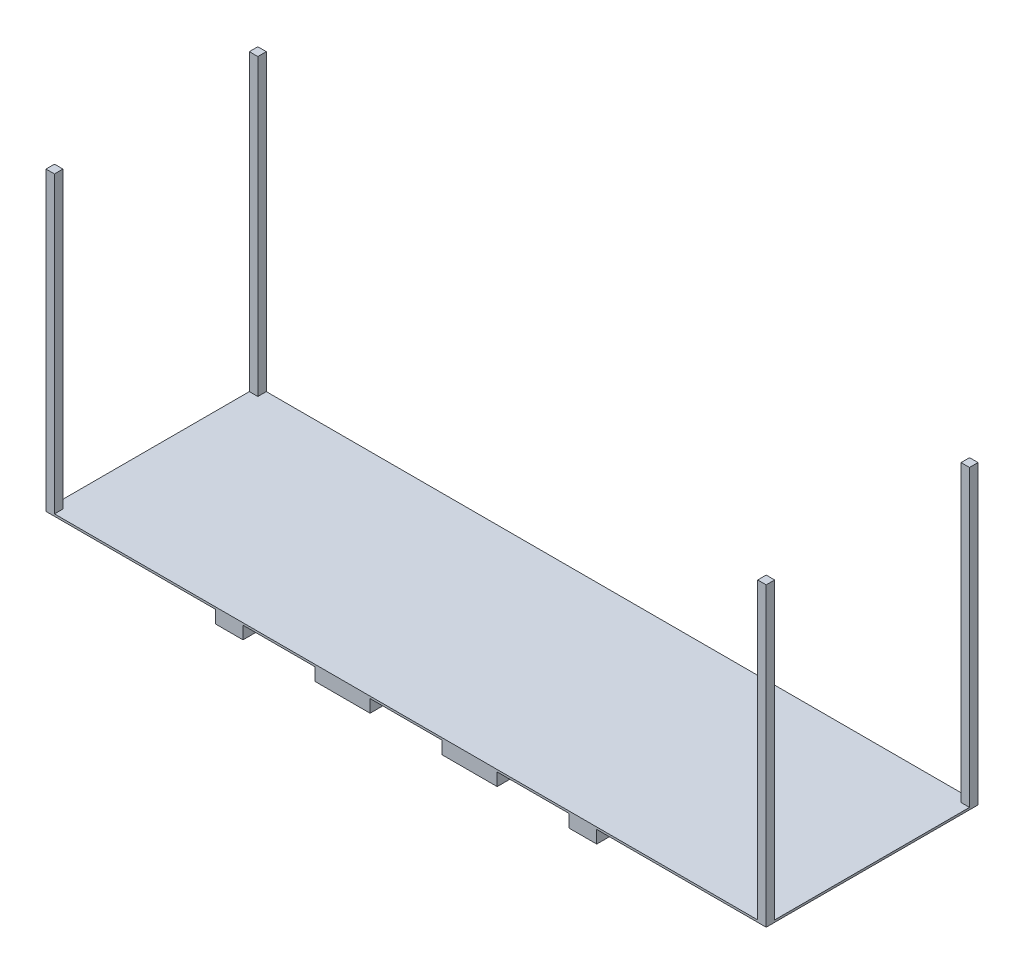
ISO-10303-21;
HEADER;
FILE_DESCRIPTION(('STEP AP214'),'2;1');
FILE_NAME('part.step','',(''),(''),'','','');
FILE_SCHEMA(('AUTOMOTIVE_DESIGN { 1 0 10303 214 1 1 1 1 }'));
ENDSEC;
DATA;
#1=APPLICATION_CONTEXT('core data for automotive mechanical design processes');
#2=APPLICATION_PROTOCOL_DEFINITION('international standard','automotive_design',2000,#1);
#3=PRODUCT_CONTEXT('',#1,'mechanical');
#4=PRODUCT('Part','Part','',(#3));
#5=PRODUCT_RELATED_PRODUCT_CATEGORY('part','',(#4));
#6=PRODUCT_DEFINITION_FORMATION('','',#4);
#7=PRODUCT_DEFINITION_CONTEXT('part definition',#1,'design');
#8=PRODUCT_DEFINITION('design','',#6,#7);
#9=PRODUCT_DEFINITION_SHAPE('','',#8);
#10=(LENGTH_UNIT() NAMED_UNIT(*) SI_UNIT(.MILLI.,.METRE.));
#11=(NAMED_UNIT(*) PLANE_ANGLE_UNIT() SI_UNIT($,.RADIAN.));
#12=(NAMED_UNIT(*) SI_UNIT($,.STERADIAN.) SOLID_ANGLE_UNIT());
#13=UNCERTAINTY_MEASURE_WITH_UNIT(LENGTH_MEASURE(1.E-05),#10,'distance_accuracy_value','');
#14=(GEOMETRIC_REPRESENTATION_CONTEXT(3) GLOBAL_UNCERTAINTY_ASSIGNED_CONTEXT((#13)) GLOBAL_UNIT_ASSIGNED_CONTEXT((#10,
#11,#12)) REPRESENTATION_CONTEXT('',''));
#15=CARTESIAN_POINT('',(0.,0.,0.));
#16=DIRECTION('',(0.,0.,1.));
#17=DIRECTION('',(1.,0.,0.));
#18=AXIS2_PLACEMENT_3D('',#15,#16,#17);
#19=CARTESIAN_POINT('',(0.,-30.,0.));
#20=DIRECTION('',(0.,1.,0.));
#21=DIRECTION('',(0.,0.,1.));
#22=AXIS2_PLACEMENT_3D('',#19,#20,#21);
#23=PLANE('',#22);
#24=DIRECTION('',(1.,0.,0.));
#25=VECTOR('',#24,1.);
#26=CARTESIAN_POINT('',(400.,-30.,-500.));
#27=LINE('',#26,#25);
#28=CARTESIAN_POINT('',(635.,-30.,-500.));
#29=VERTEX_POINT('',#28);
#30=CARTESIAN_POINT('',(765.,-30.,-500.));
#31=VERTEX_POINT('',#30);
#32=EDGE_CURVE('E340',#29,#31,#27,.T.);
#33=ORIENTED_EDGE('',*,*,#32,.T.);
#34=DIRECTION('',(0.,0.,-1.));
#35=VECTOR('',#34,1.);
#36=CARTESIAN_POINT('',(765.,-30.,-500.));
#37=LINE('',#36,#35);
#38=CARTESIAN_POINT('',(765.,-30.,0.));
#39=VERTEX_POINT('',#38);
#40=EDGE_CURVE('E247',#39,#31,#37,.T.);
#41=ORIENTED_EDGE('',*,*,#40,.F.);
#42=DIRECTION('',(-1.,0.,0.));
#43=VECTOR('',#42,1.);
#44=CARTESIAN_POINT('',(400.,-30.,0.));
#45=LINE('',#44,#43);
#46=CARTESIAN_POINT('',(635.,-30.,0.));
#47=VERTEX_POINT('',#46);
#48=EDGE_CURVE('E348',#39,#47,#45,.T.);
#49=ORIENTED_EDGE('',*,*,#48,.T.);
#50=DIRECTION('',(0.,0.,1.));
#51=VECTOR('',#50,1.);
#52=CARTESIAN_POINT('',(635.,-30.,0.));
#53=LINE('',#52,#51);
#54=EDGE_CURVE('E308',#29,#47,#53,.T.);
#55=ORIENTED_EDGE('',*,*,#54,.F.);
#56=EDGE_LOOP('',(#33,#41,#49,#55));
#57=FACE_BOUND('',#56,.T.);
#58=ADVANCED_FACE('F33',(#57),#23,.F.);
#59=CARTESIAN_POINT('',(1065.,-30.,0.));
#60=VERTEX_POINT('',#59);
#61=CARTESIAN_POINT('',(935.,-30.,0.));
#62=VERTEX_POINT('',#61);
#63=EDGE_CURVE('E347',#60,#62,#45,.T.);
#64=ORIENTED_EDGE('',*,*,#63,.T.);
#65=DIRECTION('',(0.,0.,1.));
#66=VECTOR('',#65,1.);
#67=CARTESIAN_POINT('',(935.,-30.,-500.));
#68=LINE('',#67,#66);
#69=CARTESIAN_POINT('',(935.,-30.,-500.));
#70=VERTEX_POINT('',#69);
#71=EDGE_CURVE('E261',#70,#62,#68,.T.);
#72=ORIENTED_EDGE('',*,*,#71,.F.);
#73=CARTESIAN_POINT('',(1065.,-30.,-500.));
#74=VERTEX_POINT('',#73);
#75=EDGE_CURVE('E511',#70,#74,#27,.T.);
#76=ORIENTED_EDGE('',*,*,#75,.T.);
#77=DIRECTION('',(0.,0.,-1.));
#78=VECTOR('',#77,1.);
#79=CARTESIAN_POINT('',(1065.,-30.,-500.));
#80=LINE('',#79,#78);
#81=EDGE_CURVE('E294',#60,#74,#80,.T.);
#82=ORIENTED_EDGE('',*,*,#81,.F.);
#83=EDGE_LOOP('',(#64,#72,#76,#82));
#84=FACE_BOUND('',#83,.T.);
#85=ADVANCED_FACE('F590',(#84),#23,.F.);
#86=CARTESIAN_POINT('',(400.,-30.,-500.));
#87=VERTEX_POINT('',#86);
#88=CARTESIAN_POINT('',(465.,-30.,-500.));
#89=VERTEX_POINT('',#88);
#90=EDGE_CURVE('E336',#87,#89,#27,.T.);
#91=ORIENTED_EDGE('',*,*,#90,.T.);
#92=DIRECTION('',(0.,0.,-1.));
#93=VECTOR('',#92,1.);
#94=CARTESIAN_POINT('',(465.,-30.,0.));
#95=LINE('',#94,#93);
#96=CARTESIAN_POINT('',(465.,-30.,0.));
#97=VERTEX_POINT('',#96);
#98=EDGE_CURVE('E275',#97,#89,#95,.T.);
#99=ORIENTED_EDGE('',*,*,#98,.F.);
#100=CARTESIAN_POINT('',(400.,-30.,0.));
#101=VERTEX_POINT('',#100);
#102=EDGE_CURVE('E342',#97,#101,#45,.T.);
#103=ORIENTED_EDGE('',*,*,#102,.T.);
#104=DIRECTION('',(0.,0.,-1.));
#105=VECTOR('',#104,1.);
#106=CARTESIAN_POINT('',(400.,-30.,-500.));
#107=LINE('',#106,#105);
#108=EDGE_CURVE('E331',#101,#87,#107,.T.);
#109=ORIENTED_EDGE('',*,*,#108,.T.);
#110=EDGE_LOOP('',(#91,#99,#103,#109));
#111=FACE_BOUND('',#110,.T.);
#112=ADVANCED_FACE('F530',(#111),#23,.F.);
#113=CARTESIAN_POINT('',(0.,0.,0.));
#114=DIRECTION('',(0.,-1.,0.));
#115=DIRECTION('',(0.,0.,-1.));
#116=AXIS2_PLACEMENT_3D('',#113,#114,#115);
#117=PLANE('',#116);
#118=DIRECTION('',(0.,0.,-1.));
#119=VECTOR('',#118,1.);
#120=CARTESIAN_POINT('',(400.,0.,-500.));
#121=LINE('',#120,#119);
#122=CARTESIAN_POINT('',(400.,0.,0.));
#123=VERTEX_POINT('',#122);
#124=CARTESIAN_POINT('',(400.,0.,-500.));
#125=VERTEX_POINT('',#124);
#126=EDGE_CURVE('E323',#123,#125,#121,.T.);
#127=ORIENTED_EDGE('',*,*,#126,.F.);
#128=DIRECTION('',(1.,0.,0.));
#129=VECTOR('',#128,1.);
#130=CARTESIAN_POINT('',(0.,0.,0.));
#131=LINE('',#130,#129);
#132=CARTESIAN_POINT('',(0.,0.,0.));
#133=VERTEX_POINT('',#132);
#134=EDGE_CURVE('E478',#133,#123,#131,.T.);
#135=ORIENTED_EDGE('',*,*,#134,.F.);
#136=DIRECTION('',(0.,0.,1.));
#137=VECTOR('',#136,1.);
#138=CARTESIAN_POINT('',(0.,0.,0.));
#139=LINE('',#138,#137);
#140=CARTESIAN_POINT('',(0.,0.,-500.));
#141=VERTEX_POINT('',#140);
#142=EDGE_CURVE('E464',#141,#133,#139,.T.);
#143=ORIENTED_EDGE('',*,*,#142,.F.);
#144=DIRECTION('',(-1.,0.,0.));
#145=VECTOR('',#144,1.);
#146=CARTESIAN_POINT('',(0.,0.,-500.));
#147=LINE('',#146,#145);
#148=EDGE_CURVE('E483',#125,#141,#147,.T.);
#149=ORIENTED_EDGE('',*,*,#148,.F.);
#150=EDGE_LOOP('',(#127,#135,#143,#149));
#151=FACE_BOUND('',#150,.T.);
#152=ADVANCED_FACE('F543',(#151),#117,.T.);
#153=CARTESIAN_POINT('',(0.,5.,0.));
#154=DIRECTION('',(0.,-1.,0.));
#155=DIRECTION('',(0.,0.,-1.));
#156=AXIS2_PLACEMENT_3D('',#153,#154,#155);
#157=PLANE('',#156);
#158=DIRECTION('',(0.,0.,1.));
#159=VECTOR('',#158,1.);
#160=CARTESIAN_POINT('',(1680.,5.,-500.));
#161=LINE('',#160,#159);
#162=CARTESIAN_POINT('',(1680.,5.,-500.));
#163=VERTEX_POINT('',#162);
#164=CARTESIAN_POINT('',(1680.,5.,-480.));
#165=VERTEX_POINT('',#164);
#166=EDGE_CURVE('E364',#163,#165,#161,.T.);
#167=ORIENTED_EDGE('',*,*,#166,.F.);
#168=DIRECTION('',(-1.,0.,0.));
#169=VECTOR('',#168,1.);
#170=CARTESIAN_POINT('',(0.,5.,-500.));
#171=LINE('',#170,#169);
#172=CARTESIAN_POINT('',(20.,5.,-500.));
#173=VERTEX_POINT('',#172);
#174=EDGE_CURVE('E472',#163,#173,#171,.T.);
#175=ORIENTED_EDGE('',*,*,#174,.T.);
#176=DIRECTION('',(0.,0.,-1.));
#177=VECTOR('',#176,1.);
#178=CARTESIAN_POINT('',(20.,5.,-500.));
#179=LINE('',#178,#177);
#180=CARTESIAN_POINT('',(20.,5.,-480.));
#181=VERTEX_POINT('',#180);
#182=EDGE_CURVE('E444',#181,#173,#179,.T.);
#183=ORIENTED_EDGE('',*,*,#182,.F.);
#184=DIRECTION('',(1.,0.,0.));
#185=VECTOR('',#184,1.);
#186=CARTESIAN_POINT('',(0.,5.,-480.));
#187=LINE('',#186,#185);
#188=CARTESIAN_POINT('',(0.,5.,-480.));
#189=VERTEX_POINT('',#188);
#190=EDGE_CURVE('E439',#189,#181,#187,.T.);
#191=ORIENTED_EDGE('',*,*,#190,.F.);
#192=DIRECTION('',(0.,0.,1.));
#193=VECTOR('',#192,1.);
#194=CARTESIAN_POINT('',(0.,5.,0.));
#195=LINE('',#194,#193);
#196=CARTESIAN_POINT('',(0.,5.,-20.));
#197=VERTEX_POINT('',#196);
#198=EDGE_CURVE('E465',#189,#197,#195,.T.);
#199=ORIENTED_EDGE('',*,*,#198,.T.);
#200=DIRECTION('',(-1.,0.,0.));
#201=VECTOR('',#200,1.);
#202=CARTESIAN_POINT('',(0.,5.,-20.));
#203=LINE('',#202,#201);
#204=CARTESIAN_POINT('',(20.,5.,-20.));
#205=VERTEX_POINT('',#204);
#206=EDGE_CURVE('E419',#205,#197,#203,.T.);
#207=ORIENTED_EDGE('',*,*,#206,.F.);
#208=DIRECTION('',(0.,0.,-1.));
#209=VECTOR('',#208,1.);
#210=CARTESIAN_POINT('',(20.,5.,0.));
#211=LINE('',#210,#209);
#212=CARTESIAN_POINT('',(20.,5.,0.));
#213=VERTEX_POINT('',#212);
#214=EDGE_CURVE('E414',#213,#205,#211,.T.);
#215=ORIENTED_EDGE('',*,*,#214,.F.);
#216=DIRECTION('',(1.,0.,0.));
#217=VECTOR('',#216,1.);
#218=CARTESIAN_POINT('',(0.,5.,0.));
#219=LINE('',#218,#217);
#220=CARTESIAN_POINT('',(1680.,5.,0.));
#221=VERTEX_POINT('',#220);
#222=EDGE_CURVE('E467',#213,#221,#219,.T.);
#223=ORIENTED_EDGE('',*,*,#222,.T.);
#224=DIRECTION('',(0.,0.,1.));
#225=VECTOR('',#224,1.);
#226=CARTESIAN_POINT('',(1680.,5.,-4.44089209850063E-13));
#227=LINE('',#226,#225);
#228=CARTESIAN_POINT('',(1680.,5.,-20.0000000000005));
#229=VERTEX_POINT('',#228);
#230=EDGE_CURVE('E394',#229,#221,#227,.T.);
#231=ORIENTED_EDGE('',*,*,#230,.F.);
#232=DIRECTION('',(-1.,0.,0.));
#233=VECTOR('',#232,1.);
#234=CARTESIAN_POINT('',(1700.,5.,-20.0000000000005));
#235=LINE('',#234,#233);
#236=CARTESIAN_POINT('',(1700.,5.,-20.0000000000005));
#237=VERTEX_POINT('',#236);
#238=EDGE_CURVE('E389',#237,#229,#235,.T.);
#239=ORIENTED_EDGE('',*,*,#238,.F.);
#240=DIRECTION('',(0.,0.,-1.));
#241=VECTOR('',#240,1.);
#242=CARTESIAN_POINT('',(1700.,5.,0.));
#243=LINE('',#242,#241);
#244=CARTESIAN_POINT('',(1700.,5.,-480.));
#245=VERTEX_POINT('',#244);
#246=EDGE_CURVE('E470',#237,#245,#243,.T.);
#247=ORIENTED_EDGE('',*,*,#246,.T.);
#248=DIRECTION('',(1.,0.,0.));
#249=VECTOR('',#248,1.);
#250=CARTESIAN_POINT('',(1700.,5.,-480.));
#251=LINE('',#250,#249);
#252=EDGE_CURVE('E369',#165,#245,#251,.T.);
#253=ORIENTED_EDGE('',*,*,#252,.F.);
#254=EDGE_LOOP('',(#167,#175,#183,#191,#199,#207,#215,#223,#231,#239,#247,#253));
#255=FACE_BOUND('',#254,.T.);
#256=ADVANCED_FACE('F568',(#255),#157,.F.);
#257=CARTESIAN_POINT('',(0.,5.,0.));
#258=DIRECTION('',(1.,0.,0.));
#259=DIRECTION('',(0.,0.,-1.));
#260=AXIS2_PLACEMENT_3D('',#257,#258,#259);
#261=PLANE('',#260);
#262=ORIENTED_EDGE('',*,*,#142,.T.);
#263=DIRECTION('',(0.,-1.,0.));
#264=VECTOR('',#263,1.);
#265=CARTESIAN_POINT('',(0.,5.,0.));
#266=LINE('',#265,#264);
#267=CARTESIAN_POINT('',(0.,700.,0.));
#268=VERTEX_POINT('',#267);
#269=EDGE_CURVE('E11',#268,#133,#266,.T.);
#270=ORIENTED_EDGE('',*,*,#269,.F.);
#271=DIRECTION('',(0.,0.,1.));
#272=VECTOR('',#271,1.);
#273=CARTESIAN_POINT('',(0.,700.,0.));
#274=LINE('',#273,#272);
#275=CARTESIAN_POINT('',(0.,700.,-20.));
#276=VERTEX_POINT('',#275);
#277=EDGE_CURVE('E423',#276,#268,#274,.T.);
#278=ORIENTED_EDGE('',*,*,#277,.F.);
#279=DIRECTION('',(0.,-1.,0.));
#280=VECTOR('',#279,1.);
#281=CARTESIAN_POINT('',(0.,700.,-20.));
#282=LINE('',#281,#280);
#283=EDGE_CURVE('E426',#276,#197,#282,.T.);
#284=ORIENTED_EDGE('',*,*,#283,.T.);
#285=ORIENTED_EDGE('',*,*,#198,.F.);
#286=DIRECTION('',(0.,-1.,0.));
#287=VECTOR('',#286,1.);
#288=CARTESIAN_POINT('',(0.,700.,-480.));
#289=LINE('',#288,#287);
#290=CARTESIAN_POINT('',(0.,700.,-480.));
#291=VERTEX_POINT('',#290);
#292=EDGE_CURVE('E461',#291,#189,#289,.T.);
#293=ORIENTED_EDGE('',*,*,#292,.F.);
#294=DIRECTION('',(0.,0.,1.));
#295=VECTOR('',#294,1.);
#296=CARTESIAN_POINT('',(0.,700.,-500.));
#297=LINE('',#296,#295);
#298=CARTESIAN_POINT('',(0.,700.,-500.));
#299=VERTEX_POINT('',#298);
#300=EDGE_CURVE('E440',#299,#291,#297,.T.);
#301=ORIENTED_EDGE('',*,*,#300,.F.);
#302=DIRECTION('',(0.,-1.,0.));
#303=VECTOR('',#302,1.);
#304=CARTESIAN_POINT('',(0.,5.,-500.));
#305=LINE('',#304,#303);
#306=EDGE_CURVE('E474',#299,#141,#305,.T.);
#307=ORIENTED_EDGE('',*,*,#306,.T.);
#308=EDGE_LOOP('',(#262,#270,#278,#284,#285,#293,#301,#307));
#309=FACE_BOUND('',#308,.T.);
#310=ADVANCED_FACE('F35',(#309),#261,.F.);
#311=CARTESIAN_POINT('',(0.,5.,0.));
#312=DIRECTION('',(0.,0.,-1.));
#313=DIRECTION('',(-1.,0.,0.));
#314=AXIS2_PLACEMENT_3D('',#311,#312,#313);
#315=PLANE('',#314);
#316=ORIENTED_EDGE('',*,*,#48,.F.);
#317=DIRECTION('',(0.,-1.,0.));
#318=VECTOR('',#317,1.);
#319=CARTESIAN_POINT('',(765.,0.,0.));
#320=LINE('',#319,#318);
#321=CARTESIAN_POINT('',(765.,0.,0.));
#322=VERTEX_POINT('',#321);
#323=EDGE_CURVE('E273',#322,#39,#320,.T.);
#324=ORIENTED_EDGE('',*,*,#323,.F.);
#325=DIRECTION('',(-1.,0.,0.));
#326=VECTOR('',#325,1.);
#327=CARTESIAN_POINT('',(765.,0.,0.));
#328=LINE('',#327,#326);
#329=CARTESIAN_POINT('',(935.,0.,0.));
#330=VERTEX_POINT('',#329);
#331=EDGE_CURVE('E252',#330,#322,#328,.T.);
#332=ORIENTED_EDGE('',*,*,#331,.F.);
#333=DIRECTION('',(0.,-1.,0.));
#334=VECTOR('',#333,1.);
#335=CARTESIAN_POINT('',(935.,0.,0.));
#336=LINE('',#335,#334);
#337=EDGE_CURVE('E276',#330,#62,#336,.T.);
#338=ORIENTED_EDGE('',*,*,#337,.T.);
#339=ORIENTED_EDGE('',*,*,#63,.F.);
#340=DIRECTION('',(0.,-1.,0.));
#341=VECTOR('',#340,1.);
#342=CARTESIAN_POINT('',(1065.,0.,0.));
#343=LINE('',#342,#341);
#344=CARTESIAN_POINT('',(1065.,0.,0.));
#345=VERTEX_POINT('',#344);
#346=EDGE_CURVE('E271',#345,#60,#343,.T.);
#347=ORIENTED_EDGE('',*,*,#346,.F.);
#348=DIRECTION('',(-1.,0.,0.));
#349=VECTOR('',#348,1.);
#350=CARTESIAN_POINT('',(1065.,0.,0.));
#351=LINE('',#350,#349);
#352=CARTESIAN_POINT('',(1235.,0.,0.));
#353=VERTEX_POINT('',#352);
#354=EDGE_CURVE('E290',#353,#345,#351,.T.);
#355=ORIENTED_EDGE('',*,*,#354,.F.);
#356=DIRECTION('',(0.,-1.,0.));
#357=VECTOR('',#356,1.);
#358=CARTESIAN_POINT('',(1235.,0.,0.));
#359=LINE('',#358,#357);
#360=CARTESIAN_POINT('',(1235.,-30.,0.));
#361=VERTEX_POINT('',#360);
#362=EDGE_CURVE('E298',#353,#361,#359,.T.);
#363=ORIENTED_EDGE('',*,*,#362,.T.);
#364=CARTESIAN_POINT('',(1300.,-30.,0.));
#365=VERTEX_POINT('',#364);
#366=EDGE_CURVE('E343',#365,#361,#45,.T.);
#367=ORIENTED_EDGE('',*,*,#366,.F.);
#368=DIRECTION('',(0.,1.,0.));
#369=VECTOR('',#368,1.);
#370=CARTESIAN_POINT('',(1300.,-30.,0.));
#371=LINE('',#370,#369);
#372=CARTESIAN_POINT('',(1300.,0.,0.));
#373=VERTEX_POINT('',#372);
#374=EDGE_CURVE('E355',#365,#373,#371,.T.);
#375=ORIENTED_EDGE('',*,*,#374,.T.);
#376=CARTESIAN_POINT('',(1700.,0.,0.));
#377=VERTEX_POINT('',#376);
#378=EDGE_CURVE('E477',#373,#377,#131,.T.);
#379=ORIENTED_EDGE('',*,*,#378,.T.);
#380=DIRECTION('',(0.,-1.,0.));
#381=VECTOR('',#380,1.);
#382=CARTESIAN_POINT('',(1700.,5.,0.));
#383=LINE('',#382,#381);
#384=CARTESIAN_POINT('',(1700.,700.,-4.44089209850063E-13));
#385=VERTEX_POINT('',#384);
#386=EDGE_CURVE('E41',#385,#377,#383,.T.);
#387=ORIENTED_EDGE('',*,*,#386,.F.);
#388=DIRECTION('',(1.,0.,0.));
#389=VECTOR('',#388,1.);
#390=CARTESIAN_POINT('',(1700.,700.,-4.44089209850063E-13));
#391=LINE('',#390,#389);
#392=CARTESIAN_POINT('',(1680.,700.,-4.44089209850063E-13));
#393=VERTEX_POINT('',#392);
#394=EDGE_CURVE('E398',#393,#385,#391,.T.);
#395=ORIENTED_EDGE('',*,*,#394,.F.);
#396=DIRECTION('',(0.,-1.,0.));
#397=VECTOR('',#396,1.);
#398=CARTESIAN_POINT('',(1680.,700.,-4.44089209850063E-13));
#399=LINE('',#398,#397);
#400=EDGE_CURVE('E401',#393,#221,#399,.T.);
#401=ORIENTED_EDGE('',*,*,#400,.T.);
#402=ORIENTED_EDGE('',*,*,#222,.F.);
#403=DIRECTION('',(0.,-1.,0.));
#404=VECTOR('',#403,1.);
#405=CARTESIAN_POINT('',(20.,700.,0.));
#406=LINE('',#405,#404);
#407=CARTESIAN_POINT('',(20.,700.,0.));
#408=VERTEX_POINT('',#407);
#409=EDGE_CURVE('E436',#408,#213,#406,.T.);
#410=ORIENTED_EDGE('',*,*,#409,.F.);
#411=DIRECTION('',(1.,0.,0.));
#412=VECTOR('',#411,1.);
#413=CARTESIAN_POINT('',(0.,700.,0.));
#414=LINE('',#413,#412);
#415=EDGE_CURVE('E415',#268,#408,#414,.T.);
#416=ORIENTED_EDGE('',*,*,#415,.F.);
#417=ORIENTED_EDGE('',*,*,#269,.T.);
#418=ORIENTED_EDGE('',*,*,#134,.T.);
#419=DIRECTION('',(0.,1.,0.));
#420=VECTOR('',#419,1.);
#421=CARTESIAN_POINT('',(400.,-30.,0.));
#422=LINE('',#421,#420);
#423=EDGE_CURVE('E346',#101,#123,#422,.T.);
#424=ORIENTED_EDGE('',*,*,#423,.F.);
#425=ORIENTED_EDGE('',*,*,#102,.F.);
#426=DIRECTION('',(0.,-1.,0.));
#427=VECTOR('',#426,1.);
#428=CARTESIAN_POINT('',(465.,0.,0.));
#429=LINE('',#428,#427);
#430=CARTESIAN_POINT('',(465.,0.,0.));
#431=VERTEX_POINT('',#430);
#432=EDGE_CURVE('E321',#431,#97,#429,.T.);
#433=ORIENTED_EDGE('',*,*,#432,.F.);
#434=DIRECTION('',(-1.,0.,0.));
#435=VECTOR('',#434,1.);
#436=CARTESIAN_POINT('',(465.,0.,0.));
#437=LINE('',#436,#435);
#438=CARTESIAN_POINT('',(635.,0.,0.));
#439=VERTEX_POINT('',#438);
#440=EDGE_CURVE('E314',#439,#431,#437,.T.);
#441=ORIENTED_EDGE('',*,*,#440,.F.);
#442=DIRECTION('',(0.,-1.,0.));
#443=VECTOR('',#442,1.);
#444=CARTESIAN_POINT('',(635.,0.,0.));
#445=LINE('',#444,#443);
#446=EDGE_CURVE('E324',#439,#47,#445,.T.);
#447=ORIENTED_EDGE('',*,*,#446,.T.);
#448=EDGE_LOOP('',(#316,#324,#332,#338,#339,#347,#355,#363,#367,#375,#379,#387,#395,#401,#402,
#410,#416,#417,#418,#424,#425,#433,#441,#447));
#449=FACE_BOUND('',#448,.T.);
#450=ADVANCED_FACE('F545',(#449),#315,.F.);
#451=CARTESIAN_POINT('',(1700.,5.,0.));
#452=DIRECTION('',(-1.,0.,0.));
#453=DIRECTION('',(0.,0.,1.));
#454=AXIS2_PLACEMENT_3D('',#451,#452,#453);
#455=PLANE('',#454);
#456=DIRECTION('',(0.,0.,-1.));
#457=VECTOR('',#456,1.);
#458=CARTESIAN_POINT('',(1700.,0.,0.));
#459=LINE('',#458,#457);
#460=CARTESIAN_POINT('',(1700.,0.,-500.));
#461=VERTEX_POINT('',#460);
#462=EDGE_CURVE('E481',#377,#461,#459,.T.);
#463=ORIENTED_EDGE('',*,*,#462,.T.);
#464=DIRECTION('',(0.,-1.,0.));
#465=VECTOR('',#464,1.);
#466=CARTESIAN_POINT('',(1700.,5.,-500.));
#467=LINE('',#466,#465);
#468=CARTESIAN_POINT('',(1700.,700.,-500.));
#469=VERTEX_POINT('',#468);
#470=EDGE_CURVE('E488',#469,#461,#467,.T.);
#471=ORIENTED_EDGE('',*,*,#470,.F.);
#472=DIRECTION('',(0.,0.,-1.));
#473=VECTOR('',#472,1.);
#474=CARTESIAN_POINT('',(1700.,700.,-500.));
#475=LINE('',#474,#473);
#476=CARTESIAN_POINT('',(1700.,700.,-480.));
#477=VERTEX_POINT('',#476);
#478=EDGE_CURVE('E373',#477,#469,#475,.T.);
#479=ORIENTED_EDGE('',*,*,#478,.F.);
#480=DIRECTION('',(0.,-1.,0.));
#481=VECTOR('',#480,1.);
#482=CARTESIAN_POINT('',(1700.,700.,-480.));
#483=LINE('',#482,#481);
#484=EDGE_CURVE('E376',#477,#245,#483,.T.);
#485=ORIENTED_EDGE('',*,*,#484,.T.);
#486=ORIENTED_EDGE('',*,*,#246,.F.);
#487=DIRECTION('',(0.,-1.,0.));
#488=VECTOR('',#487,1.);
#489=CARTESIAN_POINT('',(1700.,700.,-20.0000000000005));
#490=LINE('',#489,#488);
#491=CARTESIAN_POINT('',(1700.,700.,-20.0000000000005));
#492=VERTEX_POINT('',#491);
#493=EDGE_CURVE('E411',#492,#237,#490,.T.);
#494=ORIENTED_EDGE('',*,*,#493,.F.);
#495=DIRECTION('',(0.,0.,-1.));
#496=VECTOR('',#495,1.);
#497=CARTESIAN_POINT('',(1700.,700.,-4.44089209850063E-13));
#498=LINE('',#497,#496);
#499=EDGE_CURVE('E390',#385,#492,#498,.T.);
#500=ORIENTED_EDGE('',*,*,#499,.F.);
#501=ORIENTED_EDGE('',*,*,#386,.T.);
#502=EDGE_LOOP('',(#463,#471,#479,#485,#486,#494,#500,#501));
#503=FACE_BOUND('',#502,.T.);
#504=ADVANCED_FACE('F494',(#503),#455,.F.);
#505=CARTESIAN_POINT('',(0.,5.,-500.));
#506=DIRECTION('',(0.,0.,1.));
#507=DIRECTION('',(1.,0.,0.));
#508=AXIS2_PLACEMENT_3D('',#505,#506,#507);
#509=PLANE('',#508);
#510=DIRECTION('',(1.,0.,0.));
#511=VECTOR('',#510,1.);
#512=CARTESIAN_POINT('',(765.,0.,-500.));
#513=LINE('',#512,#511);
#514=CARTESIAN_POINT('',(765.,0.,-500.));
#515=VERTEX_POINT('',#514);
#516=CARTESIAN_POINT('',(935.,0.,-500.));
#517=VERTEX_POINT('',#516);
#518=EDGE_CURVE('E258',#515,#517,#513,.T.);
#519=ORIENTED_EDGE('',*,*,#518,.F.);
#520=DIRECTION('',(0.,-1.,0.));
#521=VECTOR('',#520,1.);
#522=CARTESIAN_POINT('',(765.,0.,-500.));
#523=LINE('',#522,#521);
#524=EDGE_CURVE('E241',#515,#31,#523,.T.);
#525=ORIENTED_EDGE('',*,*,#524,.T.);
#526=ORIENTED_EDGE('',*,*,#32,.F.);
#527=DIRECTION('',(0.,-1.,0.));
#528=VECTOR('',#527,1.);
#529=CARTESIAN_POINT('',(635.,0.,-500.));
#530=LINE('',#529,#528);
#531=CARTESIAN_POINT('',(635.,0.,-500.));
#532=VERTEX_POINT('',#531);
#533=EDGE_CURVE('E327',#532,#29,#530,.T.);
#534=ORIENTED_EDGE('',*,*,#533,.F.);
#535=DIRECTION('',(1.,0.,0.));
#536=VECTOR('',#535,1.);
#537=CARTESIAN_POINT('',(465.,0.,-500.));
#538=LINE('',#537,#536);
#539=CARTESIAN_POINT('',(465.,0.,-500.));
#540=VERTEX_POINT('',#539);
#541=EDGE_CURVE('E307',#540,#532,#538,.T.);
#542=ORIENTED_EDGE('',*,*,#541,.F.);
#543=DIRECTION('',(0.,-1.,0.));
#544=VECTOR('',#543,1.);
#545=CARTESIAN_POINT('',(465.,0.,-500.));
#546=LINE('',#545,#544);
#547=EDGE_CURVE('E317',#540,#89,#546,.T.);
#548=ORIENTED_EDGE('',*,*,#547,.T.);
#549=ORIENTED_EDGE('',*,*,#90,.F.);
#550=DIRECTION('',(0.,1.,0.));
#551=VECTOR('',#550,1.);
#552=CARTESIAN_POINT('',(400.,-30.,-500.));
#553=LINE('',#552,#551);
#554=EDGE_CURVE('E361',#87,#125,#553,.T.);
#555=ORIENTED_EDGE('',*,*,#554,.T.);
#556=ORIENTED_EDGE('',*,*,#148,.T.);
#557=ORIENTED_EDGE('',*,*,#306,.F.);
#558=DIRECTION('',(-1.,0.,0.));
#559=VECTOR('',#558,1.);
#560=CARTESIAN_POINT('',(0.,700.,-500.));
#561=LINE('',#560,#559);
#562=CARTESIAN_POINT('',(20.,700.,-500.));
#563=VERTEX_POINT('',#562);
#564=EDGE_CURVE('E448',#563,#299,#561,.T.);
#565=ORIENTED_EDGE('',*,*,#564,.F.);
#566=DIRECTION('',(0.,-1.,0.));
#567=VECTOR('',#566,1.);
#568=CARTESIAN_POINT('',(20.,700.,-500.));
#569=LINE('',#568,#567);
#570=EDGE_CURVE('E451',#563,#173,#569,.T.);
#571=ORIENTED_EDGE('',*,*,#570,.T.);
#572=ORIENTED_EDGE('',*,*,#174,.F.);
#573=DIRECTION('',(0.,-1.,0.));
#574=VECTOR('',#573,1.);
#575=CARTESIAN_POINT('',(1680.,700.,-500.));
#576=LINE('',#575,#574);
#577=CARTESIAN_POINT('',(1680.,700.,-500.));
#578=VERTEX_POINT('',#577);
#579=EDGE_CURVE('E386',#578,#163,#576,.T.);
#580=ORIENTED_EDGE('',*,*,#579,.F.);
#581=DIRECTION('',(-1.,0.,0.));
#582=VECTOR('',#581,1.);
#583=CARTESIAN_POINT('',(1700.,700.,-500.));
#584=LINE('',#583,#582);
#585=EDGE_CURVE('E365',#469,#578,#584,.T.);
#586=ORIENTED_EDGE('',*,*,#585,.F.);
#587=ORIENTED_EDGE('',*,*,#470,.T.);
#588=CARTESIAN_POINT('',(1300.,0.,-500.));
#589=VERTEX_POINT('',#588);
#590=EDGE_CURVE('E468',#461,#589,#147,.T.);
#591=ORIENTED_EDGE('',*,*,#590,.T.);
#592=DIRECTION('',(0.,1.,0.));
#593=VECTOR('',#592,1.);
#594=CARTESIAN_POINT('',(1300.,-30.,-500.));
#595=LINE('',#594,#593);
#596=CARTESIAN_POINT('',(1300.,-30.,-500.));
#597=VERTEX_POINT('',#596);
#598=EDGE_CURVE('E358',#597,#589,#595,.T.);
#599=ORIENTED_EDGE('',*,*,#598,.F.);
#600=CARTESIAN_POINT('',(1235.,-30.,-500.));
#601=VERTEX_POINT('',#600);
#602=EDGE_CURVE('E334',#601,#597,#27,.T.);
#603=ORIENTED_EDGE('',*,*,#602,.F.);
#604=DIRECTION('',(0.,-1.,0.));
#605=VECTOR('',#604,1.);
#606=CARTESIAN_POINT('',(1235.,0.,-500.));
#607=LINE('',#606,#605);
#608=CARTESIAN_POINT('',(1235.,0.,-500.));
#609=VERTEX_POINT('',#608);
#610=EDGE_CURVE('E48',#609,#601,#607,.T.);
#611=ORIENTED_EDGE('',*,*,#610,.F.);
#612=DIRECTION('',(1.,0.,0.));
#613=VECTOR('',#612,1.);
#614=CARTESIAN_POINT('',(1065.,0.,-500.));
#615=LINE('',#614,#613);
#616=CARTESIAN_POINT('',(1065.,0.,-500.));
#617=VERTEX_POINT('',#616);
#618=EDGE_CURVE('E283',#617,#609,#615,.T.);
#619=ORIENTED_EDGE('',*,*,#618,.F.);
#620=DIRECTION('',(0.,-1.,0.));
#621=VECTOR('',#620,1.);
#622=CARTESIAN_POINT('',(1065.,0.,-500.));
#623=LINE('',#622,#621);
#624=EDGE_CURVE('E293',#617,#74,#623,.T.);
#625=ORIENTED_EDGE('',*,*,#624,.T.);
#626=ORIENTED_EDGE('',*,*,#75,.F.);
#627=DIRECTION('',(0.,-1.,0.));
#628=VECTOR('',#627,1.);
#629=CARTESIAN_POINT('',(935.,0.,-500.));
#630=LINE('',#629,#628);
#631=EDGE_CURVE('E56',#517,#70,#630,.T.);
#632=ORIENTED_EDGE('',*,*,#631,.F.);
#633=EDGE_LOOP('',(#519,#525,#526,#534,#542,#548,#549,#555,#556,#557,#565,#571,#572,#580,#586,
#587,#591,#599,#603,#611,#619,#625,#626,#632));
#634=FACE_BOUND('',#633,.T.);
#635=ADVANCED_FACE('F263',(#634),#509,.F.);
#636=DIRECTION('',(0.,0.,1.));
#637=VECTOR('',#636,1.);
#638=CARTESIAN_POINT('',(1300.,0.,-500.));
#639=LINE('',#638,#637);
#640=EDGE_CURVE('E335',#589,#373,#639,.T.);
#641=ORIENTED_EDGE('',*,*,#640,.F.);
#642=ORIENTED_EDGE('',*,*,#590,.F.);
#643=ORIENTED_EDGE('',*,*,#462,.F.);
#644=ORIENTED_EDGE('',*,*,#378,.F.);
#645=EDGE_LOOP('',(#641,#642,#643,#644));
#646=FACE_BOUND('',#645,.T.);
#647=ADVANCED_FACE('F500',(#646),#117,.T.);
#648=CARTESIAN_POINT('',(0.,700.,-480.));
#649=DIRECTION('',(0.,0.,-1.));
#650=DIRECTION('',(-1.,0.,0.));
#651=AXIS2_PLACEMENT_3D('',#648,#649,#650);
#652=PLANE('',#651);
#653=ORIENTED_EDGE('',*,*,#190,.T.);
#654=DIRECTION('',(0.,-1.,0.));
#655=VECTOR('',#654,1.);
#656=CARTESIAN_POINT('',(20.,700.,-480.));
#657=LINE('',#656,#655);
#658=CARTESIAN_POINT('',(20.,700.,-480.));
#659=VERTEX_POINT('',#658);
#660=EDGE_CURVE('E458',#659,#181,#657,.T.);
#661=ORIENTED_EDGE('',*,*,#660,.F.);
#662=DIRECTION('',(1.,0.,0.));
#663=VECTOR('',#662,1.);
#664=CARTESIAN_POINT('',(0.,700.,-480.));
#665=LINE('',#664,#663);
#666=EDGE_CURVE('E443',#291,#659,#665,.T.);
#667=ORIENTED_EDGE('',*,*,#666,.F.);
#668=ORIENTED_EDGE('',*,*,#292,.T.);
#669=EDGE_LOOP('',(#653,#661,#667,#668));
#670=FACE_BOUND('',#669,.T.);
#671=ADVANCED_FACE('F558',(#670),#652,.F.);
#672=CARTESIAN_POINT('',(20.,700.,-500.));
#673=DIRECTION('',(-1.,0.,0.));
#674=DIRECTION('',(0.,0.,1.));
#675=AXIS2_PLACEMENT_3D('',#672,#673,#674);
#676=PLANE('',#675);
#677=ORIENTED_EDGE('',*,*,#182,.T.);
#678=ORIENTED_EDGE('',*,*,#570,.F.);
#679=DIRECTION('',(0.,0.,-1.));
#680=VECTOR('',#679,1.);
#681=CARTESIAN_POINT('',(20.,700.,-500.));
#682=LINE('',#681,#680);
#683=EDGE_CURVE('E446',#659,#563,#682,.T.);
#684=ORIENTED_EDGE('',*,*,#683,.F.);
#685=ORIENTED_EDGE('',*,*,#660,.T.);
#686=EDGE_LOOP('',(#677,#678,#684,#685));
#687=FACE_BOUND('',#686,.T.);
#688=ADVANCED_FACE('F567',(#687),#676,.F.);
#689=CARTESIAN_POINT('',(0.,700.,0.));
#690=DIRECTION('',(0.,1.,0.));
#691=DIRECTION('',(0.,0.,1.));
#692=AXIS2_PLACEMENT_3D('',#689,#690,#691);
#693=PLANE('',#692);
#694=ORIENTED_EDGE('',*,*,#300,.T.);
#695=ORIENTED_EDGE('',*,*,#666,.T.);
#696=ORIENTED_EDGE('',*,*,#683,.T.);
#697=ORIENTED_EDGE('',*,*,#564,.T.);
#698=EDGE_LOOP('',(#694,#695,#696,#697));
#699=FACE_BOUND('',#698,.T.);
#700=ADVANCED_FACE('F562',(#699),#693,.T.);
#701=CARTESIAN_POINT('',(20.,700.,0.));
#702=DIRECTION('',(-1.,0.,0.));
#703=DIRECTION('',(0.,0.,1.));
#704=AXIS2_PLACEMENT_3D('',#701,#702,#703);
#705=PLANE('',#704);
#706=ORIENTED_EDGE('',*,*,#214,.T.);
#707=DIRECTION('',(0.,-1.,0.));
#708=VECTOR('',#707,1.);
#709=CARTESIAN_POINT('',(20.,700.,-20.));
#710=LINE('',#709,#708);
#711=CARTESIAN_POINT('',(20.,700.,-20.));
#712=VERTEX_POINT('',#711);
#713=EDGE_CURVE('E433',#712,#205,#710,.T.);
#714=ORIENTED_EDGE('',*,*,#713,.F.);
#715=DIRECTION('',(0.,0.,-1.));
#716=VECTOR('',#715,1.);
#717=CARTESIAN_POINT('',(20.,700.,0.));
#718=LINE('',#717,#716);
#719=EDGE_CURVE('E418',#408,#712,#718,.T.);
#720=ORIENTED_EDGE('',*,*,#719,.F.);
#721=ORIENTED_EDGE('',*,*,#409,.T.);
#722=EDGE_LOOP('',(#706,#714,#720,#721));
#723=FACE_BOUND('',#722,.T.);
#724=ADVANCED_FACE('F702',(#723),#705,.F.);
#725=CARTESIAN_POINT('',(0.,700.,-20.));
#726=DIRECTION('',(0.,0.,1.));
#727=DIRECTION('',(1.,0.,0.));
#728=AXIS2_PLACEMENT_3D('',#725,#726,#727);
#729=PLANE('',#728);
#730=ORIENTED_EDGE('',*,*,#206,.T.);
#731=ORIENTED_EDGE('',*,*,#283,.F.);
#732=DIRECTION('',(-1.,0.,0.));
#733=VECTOR('',#732,1.);
#734=CARTESIAN_POINT('',(0.,700.,-20.));
#735=LINE('',#734,#733);
#736=EDGE_CURVE('E421',#712,#276,#735,.T.);
#737=ORIENTED_EDGE('',*,*,#736,.F.);
#738=ORIENTED_EDGE('',*,*,#713,.T.);
#739=EDGE_LOOP('',(#730,#731,#737,#738));
#740=FACE_BOUND('',#739,.T.);
#741=ADVANCED_FACE('F554',(#740),#729,.F.);
#742=CARTESIAN_POINT('',(0.,700.,0.));
#743=DIRECTION('',(0.,1.,0.));
#744=DIRECTION('',(0.,0.,1.));
#745=AXIS2_PLACEMENT_3D('',#742,#743,#744);
#746=PLANE('',#745);
#747=ORIENTED_EDGE('',*,*,#415,.T.);
#748=ORIENTED_EDGE('',*,*,#719,.T.);
#749=ORIENTED_EDGE('',*,*,#736,.T.);
#750=ORIENTED_EDGE('',*,*,#277,.T.);
#751=EDGE_LOOP('',(#747,#748,#749,#750));
#752=FACE_BOUND('',#751,.T.);
#753=ADVANCED_FACE('F549',(#752),#746,.T.);
#754=CARTESIAN_POINT('',(1700.,700.,-20.0000000000005));
#755=DIRECTION('',(0.,0.,1.));
#756=DIRECTION('',(1.,0.,0.));
#757=AXIS2_PLACEMENT_3D('',#754,#755,#756);
#758=PLANE('',#757);
#759=ORIENTED_EDGE('',*,*,#238,.T.);
#760=DIRECTION('',(0.,-1.,0.));
#761=VECTOR('',#760,1.);
#762=CARTESIAN_POINT('',(1680.,700.,-20.0000000000005));
#763=LINE('',#762,#761);
#764=CARTESIAN_POINT('',(1680.,700.,-20.0000000000005));
#765=VERTEX_POINT('',#764);
#766=EDGE_CURVE('E408',#765,#229,#763,.T.);
#767=ORIENTED_EDGE('',*,*,#766,.F.);
#768=DIRECTION('',(-1.,0.,0.));
#769=VECTOR('',#768,1.);
#770=CARTESIAN_POINT('',(1700.,700.,-20.0000000000005));
#771=LINE('',#770,#769);
#772=EDGE_CURVE('E393',#492,#765,#771,.T.);
#773=ORIENTED_EDGE('',*,*,#772,.F.);
#774=ORIENTED_EDGE('',*,*,#493,.T.);
#775=EDGE_LOOP('',(#759,#767,#773,#774));
#776=FACE_BOUND('',#775,.T.);
#777=ADVANCED_FACE('F725',(#776),#758,.F.);
#778=CARTESIAN_POINT('',(1680.,700.,-4.44089209850063E-13));
#779=DIRECTION('',(1.,0.,0.));
#780=DIRECTION('',(0.,0.,-1.));
#781=AXIS2_PLACEMENT_3D('',#778,#779,#780);
#782=PLANE('',#781);
#783=ORIENTED_EDGE('',*,*,#230,.T.);
#784=ORIENTED_EDGE('',*,*,#400,.F.);
#785=DIRECTION('',(0.,0.,1.));
#786=VECTOR('',#785,1.);
#787=CARTESIAN_POINT('',(1680.,700.,-4.44089209850063E-13));
#788=LINE('',#787,#786);
#789=EDGE_CURVE('E396',#765,#393,#788,.T.);
#790=ORIENTED_EDGE('',*,*,#789,.F.);
#791=ORIENTED_EDGE('',*,*,#766,.T.);
#792=EDGE_LOOP('',(#783,#784,#790,#791));
#793=FACE_BOUND('',#792,.T.);
#794=ADVANCED_FACE('F733',(#793),#782,.F.);
#795=CARTESIAN_POINT('',(0.,700.,0.));
#796=DIRECTION('',(0.,1.,0.));
#797=DIRECTION('',(0.,0.,1.));
#798=AXIS2_PLACEMENT_3D('',#795,#796,#797);
#799=PLANE('',#798);
#800=ORIENTED_EDGE('',*,*,#499,.T.);
#801=ORIENTED_EDGE('',*,*,#772,.T.);
#802=ORIENTED_EDGE('',*,*,#789,.T.);
#803=ORIENTED_EDGE('',*,*,#394,.T.);
#804=EDGE_LOOP('',(#800,#801,#802,#803));
#805=FACE_BOUND('',#804,.T.);
#806=ADVANCED_FACE('F587',(#805),#799,.T.);
#807=CARTESIAN_POINT('',(1680.,700.,-500.));
#808=DIRECTION('',(1.,0.,0.));
#809=DIRECTION('',(0.,0.,-1.));
#810=AXIS2_PLACEMENT_3D('',#807,#808,#809);
#811=PLANE('',#810);
#812=ORIENTED_EDGE('',*,*,#166,.T.);
#813=DIRECTION('',(0.,-1.,0.));
#814=VECTOR('',#813,1.);
#815=CARTESIAN_POINT('',(1680.,700.,-480.));
#816=LINE('',#815,#814);
#817=CARTESIAN_POINT('',(1680.,700.,-480.));
#818=VERTEX_POINT('',#817);
#819=EDGE_CURVE('E383',#818,#165,#816,.T.);
#820=ORIENTED_EDGE('',*,*,#819,.F.);
#821=DIRECTION('',(0.,0.,1.));
#822=VECTOR('',#821,1.);
#823=CARTESIAN_POINT('',(1680.,700.,-500.));
#824=LINE('',#823,#822);
#825=EDGE_CURVE('E368',#578,#818,#824,.T.);
#826=ORIENTED_EDGE('',*,*,#825,.F.);
#827=ORIENTED_EDGE('',*,*,#579,.T.);
#828=EDGE_LOOP('',(#812,#820,#826,#827));
#829=FACE_BOUND('',#828,.T.);
#830=ADVANCED_FACE('F571',(#829),#811,.F.);
#831=CARTESIAN_POINT('',(1700.,700.,-480.));
#832=DIRECTION('',(0.,0.,-1.));
#833=DIRECTION('',(-1.,0.,0.));
#834=AXIS2_PLACEMENT_3D('',#831,#832,#833);
#835=PLANE('',#834);
#836=ORIENTED_EDGE('',*,*,#252,.T.);
#837=ORIENTED_EDGE('',*,*,#484,.F.);
#838=DIRECTION('',(1.,0.,0.));
#839=VECTOR('',#838,1.);
#840=CARTESIAN_POINT('',(1700.,700.,-480.));
#841=LINE('',#840,#839);
#842=EDGE_CURVE('E371',#818,#477,#841,.T.);
#843=ORIENTED_EDGE('',*,*,#842,.F.);
#844=ORIENTED_EDGE('',*,*,#819,.T.);
#845=EDGE_LOOP('',(#836,#837,#843,#844));
#846=FACE_BOUND('',#845,.T.);
#847=ADVANCED_FACE('F579',(#846),#835,.F.);
#848=CARTESIAN_POINT('',(0.,700.,0.));
#849=DIRECTION('',(0.,1.,0.));
#850=DIRECTION('',(0.,0.,1.));
#851=AXIS2_PLACEMENT_3D('',#848,#849,#850);
#852=PLANE('',#851);
#853=ORIENTED_EDGE('',*,*,#585,.T.);
#854=ORIENTED_EDGE('',*,*,#825,.T.);
#855=ORIENTED_EDGE('',*,*,#842,.T.);
#856=ORIENTED_EDGE('',*,*,#478,.T.);
#857=EDGE_LOOP('',(#853,#854,#855,#856));
#858=FACE_BOUND('',#857,.T.);
#859=ADVANCED_FACE('F573',(#858),#852,.T.);
#860=CARTESIAN_POINT('',(400.,-30.,-500.));
#861=DIRECTION('',(1.,0.,0.));
#862=DIRECTION('',(0.,0.,-1.));
#863=AXIS2_PLACEMENT_3D('',#860,#861,#862);
#864=PLANE('',#863);
#865=ORIENTED_EDGE('',*,*,#126,.T.);
#866=ORIENTED_EDGE('',*,*,#554,.F.);
#867=ORIENTED_EDGE('',*,*,#108,.F.);
#868=ORIENTED_EDGE('',*,*,#423,.T.);
#869=EDGE_LOOP('',(#865,#866,#867,#868));
#870=FACE_BOUND('',#869,.T.);
#871=ADVANCED_FACE('F536',(#870),#864,.F.);
#872=CARTESIAN_POINT('',(1300.,-30.,-500.));
#873=DIRECTION('',(-1.,0.,0.));
#874=DIRECTION('',(0.,0.,1.));
#875=AXIS2_PLACEMENT_3D('',#872,#873,#874);
#876=PLANE('',#875);
#877=ORIENTED_EDGE('',*,*,#640,.T.);
#878=ORIENTED_EDGE('',*,*,#374,.F.);
#879=DIRECTION('',(0.,0.,1.));
#880=VECTOR('',#879,1.);
#881=CARTESIAN_POINT('',(1300.,-30.,-500.));
#882=LINE('',#881,#880);
#883=EDGE_CURVE('E339',#597,#365,#882,.T.);
#884=ORIENTED_EDGE('',*,*,#883,.F.);
#885=ORIENTED_EDGE('',*,*,#598,.T.);
#886=EDGE_LOOP('',(#877,#878,#884,#885));
#887=FACE_BOUND('',#886,.T.);
#888=ADVANCED_FACE('F506',(#887),#876,.F.);
#889=ORIENTED_EDGE('',*,*,#366,.T.);
#890=DIRECTION('',(0.,0.,1.));
#891=VECTOR('',#890,1.);
#892=CARTESIAN_POINT('',(1235.,-30.,-500.));
#893=LINE('',#892,#891);
#894=EDGE_CURVE('E284',#601,#361,#893,.T.);
#895=ORIENTED_EDGE('',*,*,#894,.F.);
#896=ORIENTED_EDGE('',*,*,#602,.T.);
#897=ORIENTED_EDGE('',*,*,#883,.T.);
#898=EDGE_LOOP('',(#889,#895,#896,#897));
#899=FACE_BOUND('',#898,.T.);
#900=ADVANCED_FACE('F510',(#899),#23,.F.);
#901=CARTESIAN_POINT('',(465.,0.,0.));
#902=DIRECTION('',(-1.,0.,0.));
#903=DIRECTION('',(0.,0.,1.));
#904=AXIS2_PLACEMENT_3D('',#901,#902,#903);
#905=PLANE('',#904);
#906=ORIENTED_EDGE('',*,*,#98,.T.);
#907=ORIENTED_EDGE('',*,*,#547,.F.);
#908=DIRECTION('',(0.,0.,-1.));
#909=VECTOR('',#908,1.);
#910=CARTESIAN_POINT('',(465.,0.,0.));
#911=LINE('',#910,#909);
#912=EDGE_CURVE('E304',#431,#540,#911,.T.);
#913=ORIENTED_EDGE('',*,*,#912,.F.);
#914=ORIENTED_EDGE('',*,*,#432,.T.);
#915=EDGE_LOOP('',(#906,#907,#913,#914));
#916=FACE_BOUND('',#915,.T.);
#917=ADVANCED_FACE('F527',(#916),#905,.F.);
#918=CARTESIAN_POINT('',(635.,0.,0.));
#919=DIRECTION('',(1.,0.,0.));
#920=DIRECTION('',(0.,0.,-1.));
#921=AXIS2_PLACEMENT_3D('',#918,#919,#920);
#922=PLANE('',#921);
#923=ORIENTED_EDGE('',*,*,#54,.T.);
#924=ORIENTED_EDGE('',*,*,#446,.F.);
#925=DIRECTION('',(0.,0.,1.));
#926=VECTOR('',#925,1.);
#927=CARTESIAN_POINT('',(635.,0.,0.));
#928=LINE('',#927,#926);
#929=EDGE_CURVE('E311',#532,#439,#928,.T.);
#930=ORIENTED_EDGE('',*,*,#929,.F.);
#931=ORIENTED_EDGE('',*,*,#533,.T.);
#932=EDGE_LOOP('',(#923,#924,#930,#931));
#933=FACE_BOUND('',#932,.T.);
#934=ADVANCED_FACE('F521',(#933),#922,.F.);
#935=CARTESIAN_POINT('',(0.,0.,0.));
#936=DIRECTION('',(0.,-1.,0.));
#937=DIRECTION('',(0.,0.,-1.));
#938=AXIS2_PLACEMENT_3D('',#935,#936,#937);
#939=PLANE('',#938);
#940=ORIENTED_EDGE('',*,*,#912,.T.);
#941=ORIENTED_EDGE('',*,*,#541,.T.);
#942=ORIENTED_EDGE('',*,*,#929,.T.);
#943=ORIENTED_EDGE('',*,*,#440,.T.);
#944=EDGE_LOOP('',(#940,#941,#942,#943));
#945=FACE_BOUND('',#944,.T.);
#946=ADVANCED_FACE('F524',(#945),#939,.T.);
#947=CARTESIAN_POINT('',(1065.,0.,-500.));
#948=DIRECTION('',(-1.,0.,0.));
#949=DIRECTION('',(0.,0.,1.));
#950=AXIS2_PLACEMENT_3D('',#947,#948,#949);
#951=PLANE('',#950);
#952=ORIENTED_EDGE('',*,*,#81,.T.);
#953=ORIENTED_EDGE('',*,*,#624,.F.);
#954=DIRECTION('',(0.,0.,-1.));
#955=VECTOR('',#954,1.);
#956=CARTESIAN_POINT('',(1065.,0.,-500.));
#957=LINE('',#956,#955);
#958=EDGE_CURVE('E280',#345,#617,#957,.T.);
#959=ORIENTED_EDGE('',*,*,#958,.F.);
#960=ORIENTED_EDGE('',*,*,#346,.T.);
#961=EDGE_LOOP('',(#952,#953,#959,#960));
#962=FACE_BOUND('',#961,.T.);
#963=ADVANCED_FACE('F822',(#962),#951,.F.);
#964=CARTESIAN_POINT('',(1235.,0.,-500.));
#965=DIRECTION('',(1.,0.,0.));
#966=DIRECTION('',(0.,0.,-1.));
#967=AXIS2_PLACEMENT_3D('',#964,#965,#966);
#968=PLANE('',#967);
#969=ORIENTED_EDGE('',*,*,#894,.T.);
#970=ORIENTED_EDGE('',*,*,#362,.F.);
#971=DIRECTION('',(0.,0.,1.));
#972=VECTOR('',#971,1.);
#973=CARTESIAN_POINT('',(1235.,0.,-500.));
#974=LINE('',#973,#972);
#975=EDGE_CURVE('E287',#609,#353,#974,.T.);
#976=ORIENTED_EDGE('',*,*,#975,.F.);
#977=ORIENTED_EDGE('',*,*,#610,.T.);
#978=EDGE_LOOP('',(#969,#970,#976,#977));
#979=FACE_BOUND('',#978,.T.);
#980=ADVANCED_FACE('F831',(#979),#968,.F.);
#981=CARTESIAN_POINT('',(0.,0.,0.));
#982=DIRECTION('',(0.,1.,0.));
#983=DIRECTION('',(0.,0.,1.));
#984=AXIS2_PLACEMENT_3D('',#981,#982,#983);
#985=PLANE('',#984);
#986=ORIENTED_EDGE('',*,*,#958,.T.);
#987=ORIENTED_EDGE('',*,*,#618,.T.);
#988=ORIENTED_EDGE('',*,*,#975,.T.);
#989=ORIENTED_EDGE('',*,*,#354,.T.);
#990=EDGE_LOOP('',(#986,#987,#988,#989));
#991=FACE_BOUND('',#990,.T.);
#992=ADVANCED_FACE('F841',(#991),#985,.F.);
#993=CARTESIAN_POINT('',(765.,0.,-500.));
#994=DIRECTION('',(-1.,0.,0.));
#995=DIRECTION('',(0.,0.,1.));
#996=AXIS2_PLACEMENT_3D('',#993,#994,#995);
#997=PLANE('',#996);
#998=ORIENTED_EDGE('',*,*,#40,.T.);
#999=ORIENTED_EDGE('',*,*,#524,.F.);
#1000=DIRECTION('',(0.,0.,-1.));
#1001=VECTOR('',#1000,1.);
#1002=CARTESIAN_POINT('',(765.,0.,-500.));
#1003=LINE('',#1002,#1001);
#1004=EDGE_CURVE('E244',#322,#515,#1003,.T.);
#1005=ORIENTED_EDGE('',*,*,#1004,.F.);
#1006=ORIENTED_EDGE('',*,*,#323,.T.);
#1007=EDGE_LOOP('',(#998,#999,#1005,#1006));
#1008=FACE_BOUND('',#1007,.T.);
#1009=ADVANCED_FACE('F243',(#1008),#997,.F.);
#1010=CARTESIAN_POINT('',(935.,0.,-500.));
#1011=DIRECTION('',(1.,0.,0.));
#1012=DIRECTION('',(0.,0.,-1.));
#1013=AXIS2_PLACEMENT_3D('',#1010,#1011,#1012);
#1014=PLANE('',#1013);
#1015=ORIENTED_EDGE('',*,*,#71,.T.);
#1016=ORIENTED_EDGE('',*,*,#337,.F.);
#1017=DIRECTION('',(0.,0.,1.));
#1018=VECTOR('',#1017,1.);
#1019=CARTESIAN_POINT('',(935.,0.,-500.));
#1020=LINE('',#1019,#1018);
#1021=EDGE_CURVE('E265',#517,#330,#1020,.T.);
#1022=ORIENTED_EDGE('',*,*,#1021,.F.);
#1023=ORIENTED_EDGE('',*,*,#631,.T.);
#1024=EDGE_LOOP('',(#1015,#1016,#1022,#1023));
#1025=FACE_BOUND('',#1024,.T.);
#1026=ADVANCED_FACE('F859',(#1025),#1014,.F.);
#1027=CARTESIAN_POINT('',(0.,0.,0.));
#1028=DIRECTION('',(0.,1.,0.));
#1029=DIRECTION('',(0.,0.,1.));
#1030=AXIS2_PLACEMENT_3D('',#1027,#1028,#1029);
#1031=PLANE('',#1030);
#1032=ORIENTED_EDGE('',*,*,#1004,.T.);
#1033=ORIENTED_EDGE('',*,*,#518,.T.);
#1034=ORIENTED_EDGE('',*,*,#1021,.T.);
#1035=ORIENTED_EDGE('',*,*,#331,.T.);
#1036=EDGE_LOOP('',(#1032,#1033,#1034,#1035));
#1037=FACE_BOUND('',#1036,.T.);
#1038=ADVANCED_FACE('F256',(#1037),#1031,.F.);
#1039=CLOSED_SHELL('',(#58,#85,#112,#152,#256,#310,#450,#504,#635,#647,#671,#688,#700,#724,#741,
#753,#777,#794,#806,#830,#847,#859,#871,#888,#900,#917,#934,#946,#963,#980,#992,#1009,#1026,#1038));
#1040=MANIFOLD_SOLID_BREP('B2',#1039);
#1041=ADVANCED_BREP_SHAPE_REPRESENTATION('',(#18,#1040),#14);
#1042=SHAPE_DEFINITION_REPRESENTATION(#9,#1041);
ENDSEC;
END-ISO-10303-21;
